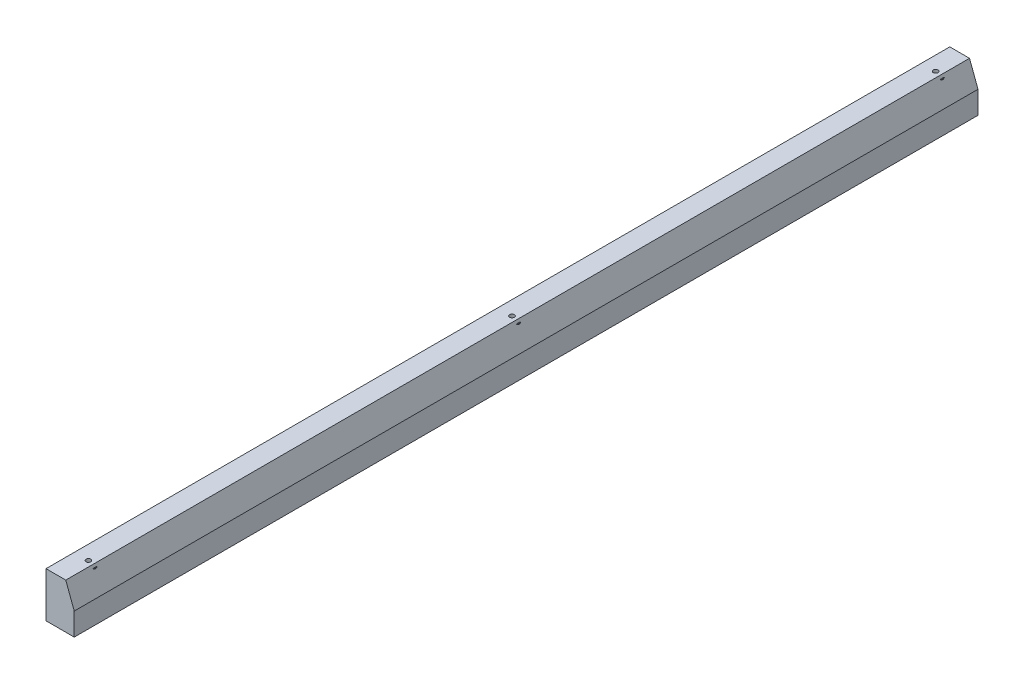
ISO-10303-21;
HEADER;
FILE_DESCRIPTION(('STEP AP214'),'2;1');
FILE_NAME('part.step','',(''),(''),'','','');
FILE_SCHEMA(('AUTOMOTIVE_DESIGN { 1 0 10303 214 1 1 1 1 }'));
ENDSEC;
DATA;
#1=APPLICATION_CONTEXT('core data for automotive mechanical design processes');
#2=APPLICATION_PROTOCOL_DEFINITION('international standard','automotive_design',2000,#1);
#3=PRODUCT_CONTEXT('',#1,'mechanical');
#4=PRODUCT('Part','Part','',(#3));
#5=PRODUCT_RELATED_PRODUCT_CATEGORY('part','',(#4));
#6=PRODUCT_DEFINITION_FORMATION('','',#4);
#7=PRODUCT_DEFINITION_CONTEXT('part definition',#1,'design');
#8=PRODUCT_DEFINITION('design','',#6,#7);
#9=PRODUCT_DEFINITION_SHAPE('','',#8);
#10=(LENGTH_UNIT() NAMED_UNIT(*) SI_UNIT(.MILLI.,.METRE.));
#11=(NAMED_UNIT(*) PLANE_ANGLE_UNIT() SI_UNIT($,.RADIAN.));
#12=(NAMED_UNIT(*) SI_UNIT($,.STERADIAN.) SOLID_ANGLE_UNIT());
#13=UNCERTAINTY_MEASURE_WITH_UNIT(LENGTH_MEASURE(1.E-05),#10,'distance_accuracy_value','');
#14=(GEOMETRIC_REPRESENTATION_CONTEXT(3) GLOBAL_UNCERTAINTY_ASSIGNED_CONTEXT((#13)) GLOBAL_UNIT_ASSIGNED_CONTEXT((#10,
#11,#12)) REPRESENTATION_CONTEXT('',''));
#15=CARTESIAN_POINT('',(0.,0.,0.));
#16=DIRECTION('',(0.,0.,1.));
#17=DIRECTION('',(1.,0.,0.));
#18=AXIS2_PLACEMENT_3D('',#15,#16,#17);
#19=CARTESIAN_POINT('',(0.,16.,320.));
#20=DIRECTION('',(1.,0.,0.));
#21=DIRECTION('',(0.,1.,0.));
#22=AXIS2_PLACEMENT_3D('',#19,#20,#21);
#23=PLANE('',#22);
#24=DIRECTION('',(0.,-1.,0.));
#25=VECTOR('',#24,1.);
#26=CARTESIAN_POINT('',(0.,16.,0.));
#27=LINE('',#26,#25);
#28=CARTESIAN_POINT('',(0.,16.,0.));
#29=VERTEX_POINT('',#28);
#30=CARTESIAN_POINT('',(0.,0.,0.));
#31=VERTEX_POINT('',#30);
#32=EDGE_CURVE('E108',#29,#31,#27,.T.);
#33=ORIENTED_EDGE('',*,*,#32,.T.);
#34=DIRECTION('',(0.,0.,-1.));
#35=VECTOR('',#34,1.);
#36=CARTESIAN_POINT('',(0.,0.,320.));
#37=LINE('',#36,#35);
#38=CARTESIAN_POINT('',(0.,0.,320.));
#39=VERTEX_POINT('',#38);
#40=EDGE_CURVE('E90',#39,#31,#37,.T.);
#41=ORIENTED_EDGE('',*,*,#40,.F.);
#42=DIRECTION('',(0.,-1.,0.));
#43=VECTOR('',#42,1.);
#44=CARTESIAN_POINT('',(0.,16.,320.));
#45=LINE('',#44,#43);
#46=CARTESIAN_POINT('',(0.,16.,320.));
#47=VERTEX_POINT('',#46);
#48=EDGE_CURVE('E96',#47,#39,#45,.T.);
#49=ORIENTED_EDGE('',*,*,#48,.F.);
#50=DIRECTION('',(0.,0.,-1.));
#51=VECTOR('',#50,1.);
#52=CARTESIAN_POINT('',(0.,16.,320.));
#53=LINE('',#52,#51);
#54=EDGE_CURVE('E113',#47,#29,#53,.T.);
#55=ORIENTED_EDGE('',*,*,#54,.T.);
#56=EDGE_LOOP('',(#33,#41,#49,#55));
#57=FACE_BOUND('',#56,.T.);
#58=ADVANCED_FACE('F39',(#57),#23,.F.);
#59=CARTESIAN_POINT('',(0.,0.,320.));
#60=DIRECTION('',(0.,1.,0.));
#61=DIRECTION('',(0.,0.,1.));
#62=AXIS2_PLACEMENT_3D('',#59,#60,#61);
#63=PLANE('',#62);
#64=CARTESIAN_POINT('',(5.,0.,310.));
#65=DIRECTION('',(0.,-1.,0.));
#66=DIRECTION('',(0.,0.,-1.));
#67=AXIS2_PLACEMENT_3D('',#64,#65,#66);
#68=CIRCLE('',#67,2.49999999999999);
#69=CARTESIAN_POINT('',(5.,0.,307.5));
#70=VERTEX_POINT('',#69);
#71=EDGE_CURVE('E136',#70,#70,#68,.T.);
#72=ORIENTED_EDGE('',*,*,#71,.F.);
#73=EDGE_LOOP('',(#72));
#74=FACE_BOUND('',#73,.T.);
#75=CARTESIAN_POINT('',(5.,0.,160.));
#76=DIRECTION('',(0.,-1.,0.));
#77=DIRECTION('',(0.,0.,-1.));
#78=AXIS2_PLACEMENT_3D('',#75,#76,#77);
#79=CIRCLE('',#78,2.49999999999999);
#80=CARTESIAN_POINT('',(5.,0.,157.5));
#81=VERTEX_POINT('',#80);
#82=EDGE_CURVE('E128',#81,#81,#79,.T.);
#83=ORIENTED_EDGE('',*,*,#82,.F.);
#84=EDGE_LOOP('',(#83));
#85=FACE_BOUND('',#84,.T.);
#86=CARTESIAN_POINT('',(5.,0.,10.));
#87=DIRECTION('',(0.,-1.,0.));
#88=DIRECTION('',(0.,0.,-1.));
#89=AXIS2_PLACEMENT_3D('',#86,#87,#88);
#90=CIRCLE('',#89,2.49999999999999);
#91=CARTESIAN_POINT('',(5.,0.,7.50000000000002));
#92=VERTEX_POINT('',#91);
#93=EDGE_CURVE('E124',#92,#92,#90,.T.);
#94=ORIENTED_EDGE('',*,*,#93,.F.);
#95=EDGE_LOOP('',(#94));
#96=FACE_BOUND('',#95,.T.);
#97=DIRECTION('',(1.,0.,0.));
#98=VECTOR('',#97,1.);
#99=CARTESIAN_POINT('',(0.,0.,0.));
#100=LINE('',#99,#98);
#101=CARTESIAN_POINT('',(10.,0.,0.));
#102=VERTEX_POINT('',#101);
#103=EDGE_CURVE('E152',#31,#102,#100,.T.);
#104=ORIENTED_EDGE('',*,*,#103,.T.);
#105=DIRECTION('',(0.,0.,-1.));
#106=VECTOR('',#105,1.);
#107=CARTESIAN_POINT('',(10.,0.,320.));
#108=LINE('',#107,#106);
#109=CARTESIAN_POINT('',(10.,0.,320.));
#110=VERTEX_POINT('',#109);
#111=EDGE_CURVE('E93',#110,#102,#108,.T.);
#112=ORIENTED_EDGE('',*,*,#111,.F.);
#113=DIRECTION('',(1.,0.,0.));
#114=VECTOR('',#113,1.);
#115=CARTESIAN_POINT('',(0.,0.,320.));
#116=LINE('',#115,#114);
#117=EDGE_CURVE('E86',#39,#110,#116,.T.);
#118=ORIENTED_EDGE('',*,*,#117,.F.);
#119=ORIENTED_EDGE('',*,*,#40,.T.);
#120=EDGE_LOOP('',(#104,#112,#118,#119));
#121=FACE_BOUND('',#120,.T.);
#122=ADVANCED_FACE('F88',(#74,#85,#96,#121),#63,.F.);
#123=CARTESIAN_POINT('',(10.,0.,320.));
#124=DIRECTION('',(-1.,0.,0.));
#125=DIRECTION('',(0.,0.,1.));
#126=AXIS2_PLACEMENT_3D('',#123,#124,#125);
#127=PLANE('',#126);
#128=DIRECTION('',(0.,1.,0.));
#129=VECTOR('',#128,1.);
#130=CARTESIAN_POINT('',(10.,0.,0.));
#131=LINE('',#130,#129);
#132=CARTESIAN_POINT('',(10.,7.99999999999988,0.));
#133=VERTEX_POINT('',#132);
#134=EDGE_CURVE('E154',#102,#133,#131,.T.);
#135=ORIENTED_EDGE('',*,*,#134,.T.);
#136=DIRECTION('',(0.,0.,1.));
#137=VECTOR('',#136,1.);
#138=CARTESIAN_POINT('',(10.,7.99999999999988,320.));
#139=LINE('',#138,#137);
#140=CARTESIAN_POINT('',(10.,7.99999999999988,320.));
#141=VERTEX_POINT('',#140);
#142=EDGE_CURVE('E47',#133,#141,#139,.T.);
#143=ORIENTED_EDGE('',*,*,#142,.T.);
#144=DIRECTION('',(0.,1.,0.));
#145=VECTOR('',#144,1.);
#146=CARTESIAN_POINT('',(10.,0.,320.));
#147=LINE('',#146,#145);
#148=EDGE_CURVE('E95',#110,#141,#147,.T.);
#149=ORIENTED_EDGE('',*,*,#148,.F.);
#150=ORIENTED_EDGE('',*,*,#111,.T.);
#151=EDGE_LOOP('',(#135,#143,#149,#150));
#152=FACE_BOUND('',#151,.T.);
#153=ADVANCED_FACE('F158',(#152),#127,.F.);
#154=CARTESIAN_POINT('',(10.,16.,320.));
#155=DIRECTION('',(0.,-1.,0.));
#156=DIRECTION('',(0.,0.,-1.));
#157=AXIS2_PLACEMENT_3D('',#154,#155,#156);
#158=PLANE('',#157);
#159=CARTESIAN_POINT('',(5.,16.,310.));
#160=DIRECTION('',(0.,-1.,0.));
#161=DIRECTION('',(0.,0.,-1.));
#162=AXIS2_PLACEMENT_3D('',#159,#160,#161);
#163=CIRCLE('',#162,0.835720517649478);
#164=CARTESIAN_POINT('',(5.,16.,309.164279482351));
#165=VERTEX_POINT('',#164);
#166=EDGE_CURVE('E126',#165,#165,#163,.T.);
#167=ORIENTED_EDGE('',*,*,#166,.T.);
#168=EDGE_LOOP('',(#167));
#169=FACE_BOUND('',#168,.T.);
#170=CARTESIAN_POINT('',(5.,16.,160.));
#171=DIRECTION('',(0.,-1.,0.));
#172=DIRECTION('',(0.,0.,-1.));
#173=AXIS2_PLACEMENT_3D('',#170,#171,#172);
#174=CIRCLE('',#173,0.835720517649478);
#175=CARTESIAN_POINT('',(5.,16.,159.164279482351));
#176=VERTEX_POINT('',#175);
#177=EDGE_CURVE('E121',#176,#176,#174,.T.);
#178=ORIENTED_EDGE('',*,*,#177,.T.);
#179=EDGE_LOOP('',(#178));
#180=FACE_BOUND('',#179,.T.);
#181=CARTESIAN_POINT('',(5.,16.,10.));
#182=DIRECTION('',(0.,-1.,0.));
#183=DIRECTION('',(0.,0.,-1.));
#184=AXIS2_PLACEMENT_3D('',#181,#182,#183);
#185=CIRCLE('',#184,0.835720517649478);
#186=CARTESIAN_POINT('',(5.,16.,9.16427948235053));
#187=VERTEX_POINT('',#186);
#188=EDGE_CURVE('E117',#187,#187,#185,.T.);
#189=ORIENTED_EDGE('',*,*,#188,.T.);
#190=EDGE_LOOP('',(#189));
#191=FACE_BOUND('',#190,.T.);
#192=DIRECTION('',(-1.,0.,0.));
#193=VECTOR('',#192,1.);
#194=CARTESIAN_POINT('',(10.,16.,320.));
#195=LINE('',#194,#193);
#196=CARTESIAN_POINT('',(6.99999999999997,16.,320.));
#197=VERTEX_POINT('',#196);
#198=EDGE_CURVE('E101',#197,#47,#195,.T.);
#199=ORIENTED_EDGE('',*,*,#198,.F.);
#200=DIRECTION('',(0.,0.,-1.));
#201=VECTOR('',#200,1.);
#202=CARTESIAN_POINT('',(6.99999999999997,16.,320.));
#203=LINE('',#202,#201);
#204=CARTESIAN_POINT('',(6.99999999999997,16.,0.));
#205=VERTEX_POINT('',#204);
#206=EDGE_CURVE('E109',#197,#205,#203,.T.);
#207=ORIENTED_EDGE('',*,*,#206,.T.);
#208=DIRECTION('',(-1.,0.,0.));
#209=VECTOR('',#208,1.);
#210=CARTESIAN_POINT('',(10.,16.,0.));
#211=LINE('',#210,#209);
#212=EDGE_CURVE('E105',#205,#29,#211,.T.);
#213=ORIENTED_EDGE('',*,*,#212,.T.);
#214=ORIENTED_EDGE('',*,*,#54,.F.);
#215=EDGE_LOOP('',(#199,#207,#213,#214));
#216=FACE_BOUND('',#215,.T.);
#217=ADVANCED_FACE('F162',(#169,#180,#191,#216),#158,.F.);
#218=CARTESIAN_POINT('',(0.,0.,320.));
#219=DIRECTION('',(0.,0.,1.));
#220=DIRECTION('',(1.,0.,0.));
#221=AXIS2_PLACEMENT_3D('',#218,#219,#220);
#222=PLANE('',#221);
#223=ORIENTED_EDGE('',*,*,#148,.T.);
#224=DIRECTION('',(0.35112344158839,-0.936329177569045,0.));
#225=VECTOR('',#224,1.);
#226=CARTESIAN_POINT('',(11.3972602739726,4.27397260273969,320.));
#227=LINE('',#226,#225);
#228=EDGE_CURVE('E11',#141,#197,#227,.F.);
#229=ORIENTED_EDGE('',*,*,#228,.T.);
#230=ORIENTED_EDGE('',*,*,#198,.T.);
#231=ORIENTED_EDGE('',*,*,#48,.T.);
#232=ORIENTED_EDGE('',*,*,#117,.T.);
#233=EDGE_LOOP('',(#223,#229,#230,#231,#232));
#234=FACE_BOUND('',#233,.T.);
#235=ADVANCED_FACE('F99',(#234),#222,.T.);
#236=CARTESIAN_POINT('',(0.,0.,0.));
#237=DIRECTION('',(0.,0.,1.));
#238=DIRECTION('',(1.,0.,0.));
#239=AXIS2_PLACEMENT_3D('',#236,#237,#238);
#240=PLANE('',#239);
#241=ORIENTED_EDGE('',*,*,#212,.F.);
#242=DIRECTION('',(-0.35112344158839,0.936329177569045,0.));
#243=VECTOR('',#242,1.);
#244=CARTESIAN_POINT('',(6.99999999999997,16.,0.));
#245=LINE('',#244,#243);
#246=EDGE_CURVE('E61',#205,#133,#245,.F.);
#247=ORIENTED_EDGE('',*,*,#246,.T.);
#248=ORIENTED_EDGE('',*,*,#134,.F.);
#249=ORIENTED_EDGE('',*,*,#103,.F.);
#250=ORIENTED_EDGE('',*,*,#32,.F.);
#251=EDGE_LOOP('',(#241,#247,#248,#249,#250));
#252=FACE_BOUND('',#251,.T.);
#253=ADVANCED_FACE('F157',(#252),#240,.F.);
#254=CARTESIAN_POINT('',(5.,15.,10.));
#255=DIRECTION('',(0.,-1.,0.));
#256=DIRECTION('',(0.,0.,-1.));
#257=AXIS2_PLACEMENT_3D('',#254,#255,#256);
#258=CONICAL_SURFACE('',#257,2.49999999999999,1.02974425867665);
#259=CARTESIAN_POINT('',(5.,15.,10.));
#260=DIRECTION('',(0.,-1.,0.));
#261=DIRECTION('',(0.,0.,-1.));
#262=AXIS2_PLACEMENT_3D('',#259,#260,#261);
#263=CIRCLE('',#262,2.49999999999999);
#264=CARTESIAN_POINT('',(5.,15.,7.50000000000002));
#265=VERTEX_POINT('',#264);
#266=EDGE_CURVE('E120',#265,#265,#263,.T.);
#267=ORIENTED_EDGE('',*,*,#266,.T.);
#268=EDGE_LOOP('',(#267));
#269=FACE_BOUND('',#268,.T.);
#270=ORIENTED_EDGE('',*,*,#188,.F.);
#271=EDGE_LOOP('',(#270));
#272=FACE_BOUND('',#271,.T.);
#273=ADVANCED_FACE('F190',(#269,#272),#258,.F.);
#274=CARTESIAN_POINT('',(5.,0.,10.));
#275=DIRECTION('',(0.,-1.,0.));
#276=DIRECTION('',(0.,0.,-1.));
#277=AXIS2_PLACEMENT_3D('',#274,#275,#276);
#278=CYLINDRICAL_SURFACE('',#277,2.49999999999999);
#279=ORIENTED_EDGE('',*,*,#266,.F.);
#280=EDGE_LOOP('',(#279));
#281=FACE_BOUND('',#280,.T.);
#282=ORIENTED_EDGE('',*,*,#93,.T.);
#283=EDGE_LOOP('',(#282));
#284=FACE_BOUND('',#283,.T.);
#285=ADVANCED_FACE('F187',(#281,#284),#278,.F.);
#286=CARTESIAN_POINT('',(5.,15.,160.));
#287=DIRECTION('',(0.,-1.,0.));
#288=DIRECTION('',(0.,0.,-1.));
#289=AXIS2_PLACEMENT_3D('',#286,#287,#288);
#290=CONICAL_SURFACE('',#289,2.49999999999999,1.02974425867665);
#291=CARTESIAN_POINT('',(5.,15.,160.));
#292=DIRECTION('',(0.,-1.,0.));
#293=DIRECTION('',(0.,0.,-1.));
#294=AXIS2_PLACEMENT_3D('',#291,#292,#293);
#295=CIRCLE('',#294,2.49999999999999);
#296=CARTESIAN_POINT('',(5.,15.,157.5));
#297=VERTEX_POINT('',#296);
#298=EDGE_CURVE('E125',#297,#297,#295,.T.);
#299=ORIENTED_EDGE('',*,*,#298,.T.);
#300=EDGE_LOOP('',(#299));
#301=FACE_BOUND('',#300,.T.);
#302=ORIENTED_EDGE('',*,*,#177,.F.);
#303=EDGE_LOOP('',(#302));
#304=FACE_BOUND('',#303,.T.);
#305=ADVANCED_FACE('F189',(#301,#304),#290,.F.);
#306=CARTESIAN_POINT('',(5.,0.,160.));
#307=DIRECTION('',(0.,-1.,0.));
#308=DIRECTION('',(0.,0.,-1.));
#309=AXIS2_PLACEMENT_3D('',#306,#307,#308);
#310=CYLINDRICAL_SURFACE('',#309,2.49999999999999);
#311=ORIENTED_EDGE('',*,*,#298,.F.);
#312=EDGE_LOOP('',(#311));
#313=FACE_BOUND('',#312,.T.);
#314=ORIENTED_EDGE('',*,*,#82,.T.);
#315=EDGE_LOOP('',(#314));
#316=FACE_BOUND('',#315,.T.);
#317=ADVANCED_FACE('F197',(#313,#316),#310,.F.);
#318=CARTESIAN_POINT('',(5.,15.,310.));
#319=DIRECTION('',(0.,-1.,0.));
#320=DIRECTION('',(0.,0.,-1.));
#321=AXIS2_PLACEMENT_3D('',#318,#319,#320);
#322=CONICAL_SURFACE('',#321,2.49999999999999,1.02974425867665);
#323=CARTESIAN_POINT('',(5.,15.,310.));
#324=DIRECTION('',(0.,-1.,0.));
#325=DIRECTION('',(0.,0.,-1.));
#326=AXIS2_PLACEMENT_3D('',#323,#324,#325);
#327=CIRCLE('',#326,2.49999999999999);
#328=CARTESIAN_POINT('',(5.,15.,307.5));
#329=VERTEX_POINT('',#328);
#330=EDGE_CURVE('E129',#329,#329,#327,.T.);
#331=ORIENTED_EDGE('',*,*,#330,.T.);
#332=EDGE_LOOP('',(#331));
#333=FACE_BOUND('',#332,.T.);
#334=ORIENTED_EDGE('',*,*,#166,.F.);
#335=EDGE_LOOP('',(#334));
#336=FACE_BOUND('',#335,.T.);
#337=ADVANCED_FACE('F239',(#333,#336),#322,.F.);
#338=CARTESIAN_POINT('',(5.,0.,310.));
#339=DIRECTION('',(0.,-1.,0.));
#340=DIRECTION('',(0.,0.,-1.));
#341=AXIS2_PLACEMENT_3D('',#338,#339,#340);
#342=CYLINDRICAL_SURFACE('',#341,2.49999999999999);
#343=ORIENTED_EDGE('',*,*,#330,.F.);
#344=EDGE_LOOP('',(#343));
#345=FACE_BOUND('',#344,.T.);
#346=ORIENTED_EDGE('',*,*,#71,.T.);
#347=EDGE_LOOP('',(#346));
#348=FACE_BOUND('',#347,.T.);
#349=ADVANCED_FACE('F250',(#345,#348),#342,.F.);
#350=CARTESIAN_POINT('',(6.99999999999997,16.,320.));
#351=DIRECTION('',(-0.936329177569045,-0.35112344158839,0.));
#352=DIRECTION('',(0.,0.,-1.));
#353=AXIS2_PLACEMENT_3D('',#350,#351,#352);
#354=PLANE('',#353);
#355=ORIENTED_EDGE('',*,*,#228,.F.);
#356=ORIENTED_EDGE('',*,*,#142,.F.);
#357=ORIENTED_EDGE('',*,*,#246,.F.);
#358=ORIENTED_EDGE('',*,*,#206,.F.);
#359=EDGE_LOOP('',(#355,#356,#357,#358));
#360=FACE_BOUND('',#359,.T.);
#361=ADVANCED_FACE('F41',(#360),#354,.F.);
#362=CLOSED_SHELL('',(#58,#122,#153,#217,#235,#253,#273,#285,#305,#317,#337,#349,#361));
#363=MANIFOLD_SOLID_BREP('B2',#362);
#364=ADVANCED_BREP_SHAPE_REPRESENTATION('',(#18,#363),#14);
#365=SHAPE_DEFINITION_REPRESENTATION(#9,#364);
ENDSEC;
END-ISO-10303-21;
